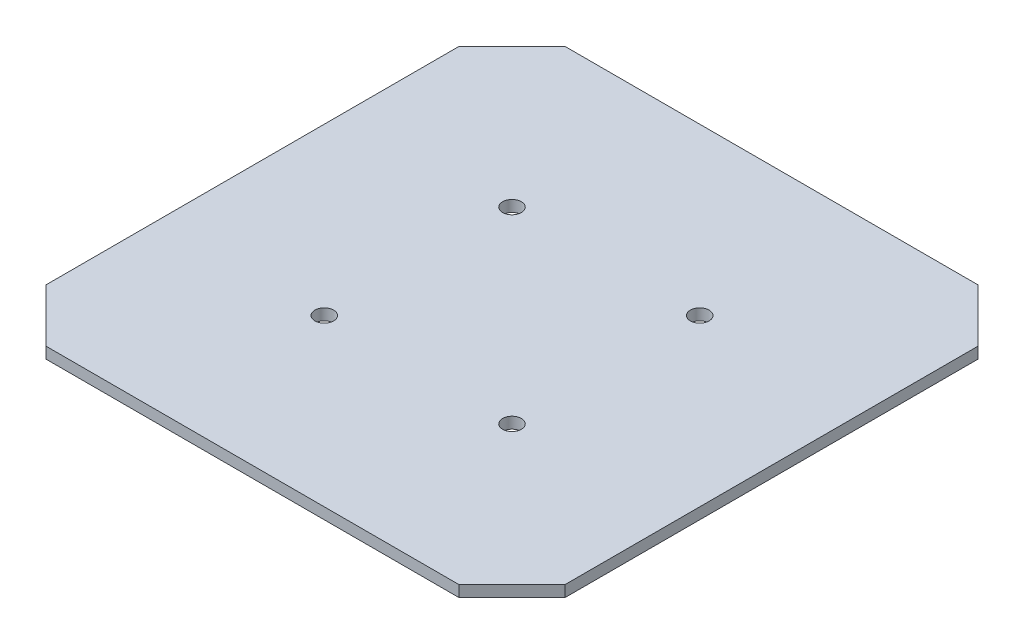
ISO-10303-21;
HEADER;
FILE_DESCRIPTION(('STEP AP214'),'2;1');
FILE_NAME('part.step','',(''),(''),'','','');
FILE_SCHEMA(('AUTOMOTIVE_DESIGN { 1 0 10303 214 1 1 1 1 }'));
ENDSEC;
DATA;
#1=APPLICATION_CONTEXT('core data for automotive mechanical design processes');
#2=APPLICATION_PROTOCOL_DEFINITION('international standard','automotive_design',2000,#1);
#3=PRODUCT_CONTEXT('',#1,'mechanical');
#4=PRODUCT('Part','Part','',(#3));
#5=PRODUCT_RELATED_PRODUCT_CATEGORY('part','',(#4));
#6=PRODUCT_DEFINITION_FORMATION('','',#4);
#7=PRODUCT_DEFINITION_CONTEXT('part definition',#1,'design');
#8=PRODUCT_DEFINITION('design','',#6,#7);
#9=PRODUCT_DEFINITION_SHAPE('','',#8);
#10=(LENGTH_UNIT() NAMED_UNIT(*) SI_UNIT(.MILLI.,.METRE.));
#11=(NAMED_UNIT(*) PLANE_ANGLE_UNIT() SI_UNIT($,.RADIAN.));
#12=(NAMED_UNIT(*) SI_UNIT($,.STERADIAN.) SOLID_ANGLE_UNIT());
#13=UNCERTAINTY_MEASURE_WITH_UNIT(LENGTH_MEASURE(1.E-05),#10,'distance_accuracy_value','');
#14=(GEOMETRIC_REPRESENTATION_CONTEXT(3) GLOBAL_UNCERTAINTY_ASSIGNED_CONTEXT((#13)) GLOBAL_UNIT_ASSIGNED_CONTEXT((#10,
#11,#12)) REPRESENTATION_CONTEXT('',''));
#15=CARTESIAN_POINT('',(0.,0.,0.));
#16=DIRECTION('',(0.,0.,1.));
#17=DIRECTION('',(1.,0.,0.));
#18=AXIS2_PLACEMENT_3D('',#15,#16,#17);
#19=CARTESIAN_POINT('',(-62.0710678118657,3.,-62.0710678118653));
#20=DIRECTION('',(-0.70710678118655,0.,-0.707106781186545));
#21=DIRECTION('',(-0.707106781186545,0.,0.70710678118655));
#22=AXIS2_PLACEMENT_3D('',#19,#20,#21);
#23=PLANE('',#22);
#24=DIRECTION('',(0.707106781186545,0.,-0.70710678118655));
#25=VECTOR('',#24,1.);
#26=CARTESIAN_POINT('',(-62.0710678118657,0.,-62.0710678118653));
#27=LINE('',#26,#25);
#28=CARTESIAN_POINT('',(-69.1421356237309,0.,-55.));
#29=VERTEX_POINT('',#28);
#30=CARTESIAN_POINT('',(-55.,0.,-69.142135623731));
#31=VERTEX_POINT('',#30);
#32=EDGE_CURVE('E144',#29,#31,#27,.T.);
#33=ORIENTED_EDGE('',*,*,#32,.F.);
#34=DIRECTION('',(0.,-1.,0.));
#35=VECTOR('',#34,1.);
#36=CARTESIAN_POINT('',(-69.1421356237309,3.,-55.));
#37=LINE('',#36,#35);
#38=CARTESIAN_POINT('',(-69.1421356237309,3.,-55.));
#39=VERTEX_POINT('',#38);
#40=EDGE_CURVE('E11',#39,#29,#37,.T.);
#41=ORIENTED_EDGE('',*,*,#40,.F.);
#42=DIRECTION('',(0.707106781186545,0.,-0.70710678118655));
#43=VECTOR('',#42,1.);
#44=CARTESIAN_POINT('',(-62.0710678118657,3.,-62.0710678118653));
#45=LINE('',#44,#43);
#46=CARTESIAN_POINT('',(-55.,3.,-69.142135623731));
#47=VERTEX_POINT('',#46);
#48=EDGE_CURVE('E173',#39,#47,#45,.T.);
#49=ORIENTED_EDGE('',*,*,#48,.T.);
#50=DIRECTION('',(0.,-1.,0.));
#51=VECTOR('',#50,1.);
#52=CARTESIAN_POINT('',(-55.,3.,-69.142135623731));
#53=LINE('',#52,#51);
#54=EDGE_CURVE('E54',#47,#31,#53,.T.);
#55=ORIENTED_EDGE('',*,*,#54,.T.);
#56=EDGE_LOOP('',(#33,#41,#49,#55));
#57=FACE_BOUND('',#56,.T.);
#58=ADVANCED_FACE('F38',(#57),#23,.T.);
#59=CARTESIAN_POINT('',(-69.1421356237309,3.,0.));
#60=DIRECTION('',(1.,0.,0.));
#61=DIRECTION('',(0.,0.,-1.));
#62=AXIS2_PLACEMENT_3D('',#59,#60,#61);
#63=PLANE('',#62);
#64=DIRECTION('',(0.,0.,1.));
#65=VECTOR('',#64,1.);
#66=CARTESIAN_POINT('',(-69.1421356237309,0.,0.));
#67=LINE('',#66,#65);
#68=CARTESIAN_POINT('',(-69.1421356237309,0.,55.));
#69=VERTEX_POINT('',#68);
#70=EDGE_CURVE('E146',#29,#69,#67,.T.);
#71=ORIENTED_EDGE('',*,*,#70,.T.);
#72=DIRECTION('',(0.,-1.,0.));
#73=VECTOR('',#72,1.);
#74=CARTESIAN_POINT('',(-69.1421356237309,3.,55.));
#75=LINE('',#74,#73);
#76=CARTESIAN_POINT('',(-69.1421356237309,3.,55.));
#77=VERTEX_POINT('',#76);
#78=EDGE_CURVE('E46',#77,#69,#75,.T.);
#79=ORIENTED_EDGE('',*,*,#78,.F.);
#80=DIRECTION('',(0.,0.,1.));
#81=VECTOR('',#80,1.);
#82=CARTESIAN_POINT('',(-69.1421356237309,3.,0.));
#83=LINE('',#82,#81);
#84=EDGE_CURVE('E207',#39,#77,#83,.T.);
#85=ORIENTED_EDGE('',*,*,#84,.F.);
#86=ORIENTED_EDGE('',*,*,#40,.T.);
#87=EDGE_LOOP('',(#71,#79,#85,#86));
#88=FACE_BOUND('',#87,.T.);
#89=ADVANCED_FACE('F225',(#88),#63,.F.);
#90=CARTESIAN_POINT('',(-62.0710678118657,3.,62.0710678118653));
#91=DIRECTION('',(0.70710678118655,0.,-0.707106781186545));
#92=DIRECTION('',(-0.707106781186545,0.,-0.70710678118655));
#93=AXIS2_PLACEMENT_3D('',#90,#91,#92);
#94=PLANE('',#93);
#95=DIRECTION('',(0.707106781186545,0.,0.70710678118655));
#96=VECTOR('',#95,1.);
#97=CARTESIAN_POINT('',(-62.0710678118657,0.,62.0710678118653));
#98=LINE('',#97,#96);
#99=CARTESIAN_POINT('',(-55.,0.,69.142135623731));
#100=VERTEX_POINT('',#99);
#101=EDGE_CURVE('E148',#69,#100,#98,.T.);
#102=ORIENTED_EDGE('',*,*,#101,.T.);
#103=DIRECTION('',(0.,-1.,0.));
#104=VECTOR('',#103,1.);
#105=CARTESIAN_POINT('',(-55.,3.,69.142135623731));
#106=LINE('',#105,#104);
#107=CARTESIAN_POINT('',(-55.,3.,69.142135623731));
#108=VERTEX_POINT('',#107);
#109=EDGE_CURVE('E180',#108,#100,#106,.T.);
#110=ORIENTED_EDGE('',*,*,#109,.F.);
#111=DIRECTION('',(0.707106781186545,0.,0.70710678118655));
#112=VECTOR('',#111,1.);
#113=CARTESIAN_POINT('',(-62.0710678118657,3.,62.0710678118653));
#114=LINE('',#113,#112);
#115=EDGE_CURVE('E189',#77,#108,#114,.T.);
#116=ORIENTED_EDGE('',*,*,#115,.F.);
#117=ORIENTED_EDGE('',*,*,#78,.T.);
#118=EDGE_LOOP('',(#102,#110,#116,#117));
#119=FACE_BOUND('',#118,.T.);
#120=ADVANCED_FACE('F187',(#119),#94,.F.);
#121=CARTESIAN_POINT('',(0.,3.,69.142135623731));
#122=DIRECTION('',(0.,0.,-1.));
#123=DIRECTION('',(-1.,0.,0.));
#124=AXIS2_PLACEMENT_3D('',#121,#122,#123);
#125=PLANE('',#124);
#126=DIRECTION('',(1.,0.,0.));
#127=VECTOR('',#126,1.);
#128=CARTESIAN_POINT('',(0.,0.,69.142135623731));
#129=LINE('',#128,#127);
#130=CARTESIAN_POINT('',(55.,0.,69.142135623731));
#131=VERTEX_POINT('',#130);
#132=EDGE_CURVE('E150',#100,#131,#129,.T.);
#133=ORIENTED_EDGE('',*,*,#132,.T.);
#134=DIRECTION('',(0.,-1.,0.));
#135=VECTOR('',#134,1.);
#136=CARTESIAN_POINT('',(55.,3.,69.142135623731));
#137=LINE('',#136,#135);
#138=CARTESIAN_POINT('',(55.,3.,69.142135623731));
#139=VERTEX_POINT('',#138);
#140=EDGE_CURVE('E177',#139,#131,#137,.T.);
#141=ORIENTED_EDGE('',*,*,#140,.F.);
#142=DIRECTION('',(1.,0.,0.));
#143=VECTOR('',#142,1.);
#144=CARTESIAN_POINT('',(0.,3.,69.142135623731));
#145=LINE('',#144,#143);
#146=EDGE_CURVE('E203',#108,#139,#145,.T.);
#147=ORIENTED_EDGE('',*,*,#146,.F.);
#148=ORIENTED_EDGE('',*,*,#109,.T.);
#149=EDGE_LOOP('',(#133,#141,#147,#148));
#150=FACE_BOUND('',#149,.T.);
#151=ADVANCED_FACE('F199',(#150),#125,.F.);
#152=CARTESIAN_POINT('',(62.0710678118657,3.,62.0710678118653));
#153=DIRECTION('',(-0.70710678118655,0.,-0.707106781186545));
#154=DIRECTION('',(-0.707106781186545,0.,0.70710678118655));
#155=AXIS2_PLACEMENT_3D('',#152,#153,#154);
#156=PLANE('',#155);
#157=DIRECTION('',(0.707106781186545,0.,-0.70710678118655));
#158=VECTOR('',#157,1.);
#159=CARTESIAN_POINT('',(62.0710678118657,0.,62.0710678118653));
#160=LINE('',#159,#158);
#161=CARTESIAN_POINT('',(69.1421356237309,0.,55.));
#162=VERTEX_POINT('',#161);
#163=EDGE_CURVE('E152',#131,#162,#160,.T.);
#164=ORIENTED_EDGE('',*,*,#163,.T.);
#165=DIRECTION('',(0.,-1.,0.));
#166=VECTOR('',#165,1.);
#167=CARTESIAN_POINT('',(69.1421356237309,3.,55.));
#168=LINE('',#167,#166);
#169=CARTESIAN_POINT('',(69.1421356237309,3.,55.));
#170=VERTEX_POINT('',#169);
#171=EDGE_CURVE('E113',#170,#162,#168,.T.);
#172=ORIENTED_EDGE('',*,*,#171,.F.);
#173=DIRECTION('',(0.707106781186545,0.,-0.70710678118655));
#174=VECTOR('',#173,1.);
#175=CARTESIAN_POINT('',(62.0710678118657,3.,62.0710678118653));
#176=LINE('',#175,#174);
#177=EDGE_CURVE('E123',#139,#170,#176,.T.);
#178=ORIENTED_EDGE('',*,*,#177,.F.);
#179=ORIENTED_EDGE('',*,*,#140,.T.);
#180=EDGE_LOOP('',(#164,#172,#178,#179));
#181=FACE_BOUND('',#180,.T.);
#182=ADVANCED_FACE('F202',(#181),#156,.F.);
#183=CARTESIAN_POINT('',(69.1421356237309,3.,0.));
#184=DIRECTION('',(1.,0.,0.));
#185=DIRECTION('',(0.,0.,-1.));
#186=AXIS2_PLACEMENT_3D('',#183,#184,#185);
#187=PLANE('',#186);
#188=DIRECTION('',(0.,0.,1.));
#189=VECTOR('',#188,1.);
#190=CARTESIAN_POINT('',(69.1421356237309,0.,0.));
#191=LINE('',#190,#189);
#192=CARTESIAN_POINT('',(69.1421356237309,0.,-55.));
#193=VERTEX_POINT('',#192);
#194=EDGE_CURVE('E109',#193,#162,#191,.T.);
#195=ORIENTED_EDGE('',*,*,#194,.F.);
#196=DIRECTION('',(0.,-1.,0.));
#197=VECTOR('',#196,1.);
#198=CARTESIAN_POINT('',(69.1421356237309,3.,-55.));
#199=LINE('',#198,#197);
#200=CARTESIAN_POINT('',(69.1421356237309,3.,-55.));
#201=VERTEX_POINT('',#200);
#202=EDGE_CURVE('E104',#201,#193,#199,.T.);
#203=ORIENTED_EDGE('',*,*,#202,.F.);
#204=DIRECTION('',(0.,0.,1.));
#205=VECTOR('',#204,1.);
#206=CARTESIAN_POINT('',(69.1421356237309,3.,0.));
#207=LINE('',#206,#205);
#208=EDGE_CURVE('E107',#201,#170,#207,.T.);
#209=ORIENTED_EDGE('',*,*,#208,.T.);
#210=ORIENTED_EDGE('',*,*,#171,.T.);
#211=EDGE_LOOP('',(#195,#203,#209,#210));
#212=FACE_BOUND('',#211,.T.);
#213=ADVANCED_FACE('F106',(#212),#187,.T.);
#214=CARTESIAN_POINT('',(62.0710678118656,3.,-62.0710678118653));
#215=DIRECTION('',(0.707106781186549,0.,-0.707106781186546));
#216=DIRECTION('',(-0.707106781186546,0.,-0.707106781186549));
#217=AXIS2_PLACEMENT_3D('',#214,#215,#216);
#218=PLANE('',#217);
#219=DIRECTION('',(0.707106781186546,0.,0.707106781186549));
#220=VECTOR('',#219,1.);
#221=CARTESIAN_POINT('',(62.0710678118656,0.,-62.0710678118653));
#222=LINE('',#221,#220);
#223=CARTESIAN_POINT('',(55.,0.,-69.142135623731));
#224=VERTEX_POINT('',#223);
#225=EDGE_CURVE('E156',#224,#193,#222,.T.);
#226=ORIENTED_EDGE('',*,*,#225,.F.);
#227=DIRECTION('',(0.,-1.,0.));
#228=VECTOR('',#227,1.);
#229=CARTESIAN_POINT('',(55.,3.,-69.142135623731));
#230=LINE('',#229,#228);
#231=CARTESIAN_POINT('',(55.,3.,-69.142135623731));
#232=VERTEX_POINT('',#231);
#233=EDGE_CURVE('E79',#232,#224,#230,.T.);
#234=ORIENTED_EDGE('',*,*,#233,.F.);
#235=DIRECTION('',(0.707106781186546,0.,0.707106781186549));
#236=VECTOR('',#235,1.);
#237=CARTESIAN_POINT('',(62.0710678118656,3.,-62.0710678118653));
#238=LINE('',#237,#236);
#239=EDGE_CURVE('E121',#232,#201,#238,.T.);
#240=ORIENTED_EDGE('',*,*,#239,.T.);
#241=ORIENTED_EDGE('',*,*,#202,.T.);
#242=EDGE_LOOP('',(#226,#234,#240,#241));
#243=FACE_BOUND('',#242,.T.);
#244=ADVANCED_FACE('F126',(#243),#218,.T.);
#245=CARTESIAN_POINT('',(25.0000000000001,3.,-25.));
#246=DIRECTION('',(0.,-1.,0.));
#247=DIRECTION('',(0.,0.,-1.));
#248=AXIS2_PLACEMENT_3D('',#245,#246,#247);
#249=CYLINDRICAL_SURFACE('',#248,2.5);
#250=CARTESIAN_POINT('',(25.0000000000001,3.,-25.));
#251=DIRECTION('',(0.,1.,0.));
#252=DIRECTION('',(0.,0.,1.));
#253=AXIS2_PLACEMENT_3D('',#250,#251,#252);
#254=CIRCLE('',#253,2.5);
#255=CARTESIAN_POINT('',(25.0000000000001,3.,-22.5));
#256=VERTEX_POINT('',#255);
#257=EDGE_CURVE('E138',#256,#256,#254,.T.);
#258=ORIENTED_EDGE('',*,*,#257,.T.);
#259=EDGE_LOOP('',(#258));
#260=FACE_BOUND('',#259,.T.);
#261=CARTESIAN_POINT('',(25.0000000000001,0.,-25.));
#262=DIRECTION('',(0.,1.,0.));
#263=DIRECTION('',(0.,0.,1.));
#264=AXIS2_PLACEMENT_3D('',#261,#262,#263);
#265=CIRCLE('',#264,2.5);
#266=CARTESIAN_POINT('',(25.0000000000001,0.,-22.5));
#267=VERTEX_POINT('',#266);
#268=EDGE_CURVE('E167',#267,#267,#265,.T.);
#269=ORIENTED_EDGE('',*,*,#268,.F.);
#270=EDGE_LOOP('',(#269));
#271=FACE_BOUND('',#270,.T.);
#272=ADVANCED_FACE('F240',(#260,#271),#249,.F.);
#273=CARTESIAN_POINT('',(25.0000000000001,3.,25.));
#274=DIRECTION('',(0.,-1.,0.));
#275=DIRECTION('',(0.,0.,-1.));
#276=AXIS2_PLACEMENT_3D('',#273,#274,#275);
#277=CYLINDRICAL_SURFACE('',#276,2.5);
#278=CARTESIAN_POINT('',(25.0000000000001,3.,25.));
#279=DIRECTION('',(0.,1.,0.));
#280=DIRECTION('',(0.,0.,1.));
#281=AXIS2_PLACEMENT_3D('',#278,#279,#280);
#282=CIRCLE('',#281,2.5);
#283=CARTESIAN_POINT('',(25.0000000000001,3.,27.5));
#284=VERTEX_POINT('',#283);
#285=EDGE_CURVE('E135',#284,#284,#282,.T.);
#286=ORIENTED_EDGE('',*,*,#285,.T.);
#287=EDGE_LOOP('',(#286));
#288=FACE_BOUND('',#287,.T.);
#289=CARTESIAN_POINT('',(25.0000000000001,0.,25.));
#290=DIRECTION('',(0.,1.,0.));
#291=DIRECTION('',(0.,0.,1.));
#292=AXIS2_PLACEMENT_3D('',#289,#290,#291);
#293=CIRCLE('',#292,2.5);
#294=CARTESIAN_POINT('',(25.0000000000001,0.,27.5));
#295=VERTEX_POINT('',#294);
#296=EDGE_CURVE('E164',#295,#295,#293,.T.);
#297=ORIENTED_EDGE('',*,*,#296,.F.);
#298=EDGE_LOOP('',(#297));
#299=FACE_BOUND('',#298,.T.);
#300=ADVANCED_FACE('F220',(#288,#299),#277,.F.);
#301=CARTESIAN_POINT('',(-24.9999999999999,3.,25.));
#302=DIRECTION('',(0.,-1.,0.));
#303=DIRECTION('',(0.,0.,-1.));
#304=AXIS2_PLACEMENT_3D('',#301,#302,#303);
#305=CYLINDRICAL_SURFACE('',#304,2.5);
#306=CARTESIAN_POINT('',(-24.9999999999999,3.,25.));
#307=DIRECTION('',(0.,1.,0.));
#308=DIRECTION('',(0.,0.,1.));
#309=AXIS2_PLACEMENT_3D('',#306,#307,#308);
#310=CIRCLE('',#309,2.5);
#311=CARTESIAN_POINT('',(-24.9999999999999,3.,27.5));
#312=VERTEX_POINT('',#311);
#313=EDGE_CURVE('E129',#312,#312,#310,.T.);
#314=ORIENTED_EDGE('',*,*,#313,.T.);
#315=EDGE_LOOP('',(#314));
#316=FACE_BOUND('',#315,.T.);
#317=CARTESIAN_POINT('',(-24.9999999999999,0.,25.));
#318=DIRECTION('',(0.,1.,0.));
#319=DIRECTION('',(0.,0.,1.));
#320=AXIS2_PLACEMENT_3D('',#317,#318,#319);
#321=CIRCLE('',#320,2.5);
#322=CARTESIAN_POINT('',(-24.9999999999999,0.,27.5));
#323=VERTEX_POINT('',#322);
#324=EDGE_CURVE('E161',#323,#323,#321,.T.);
#325=ORIENTED_EDGE('',*,*,#324,.F.);
#326=EDGE_LOOP('',(#325));
#327=FACE_BOUND('',#326,.T.);
#328=ADVANCED_FACE('F212',(#316,#327),#305,.F.);
#329=CARTESIAN_POINT('',(0.,3.,-69.142135623731));
#330=DIRECTION('',(0.,0.,-1.));
#331=DIRECTION('',(-1.,0.,0.));
#332=AXIS2_PLACEMENT_3D('',#329,#330,#331);
#333=PLANE('',#332);
#334=DIRECTION('',(1.,0.,0.));
#335=VECTOR('',#334,1.);
#336=CARTESIAN_POINT('',(0.,0.,-69.142135623731));
#337=LINE('',#336,#335);
#338=EDGE_CURVE('E158',#31,#224,#337,.T.);
#339=ORIENTED_EDGE('',*,*,#338,.F.);
#340=ORIENTED_EDGE('',*,*,#54,.F.);
#341=DIRECTION('',(1.,0.,0.));
#342=VECTOR('',#341,1.);
#343=CARTESIAN_POINT('',(0.,3.,-69.142135623731));
#344=LINE('',#343,#342);
#345=EDGE_CURVE('E127',#47,#232,#344,.T.);
#346=ORIENTED_EDGE('',*,*,#345,.T.);
#347=ORIENTED_EDGE('',*,*,#233,.T.);
#348=EDGE_LOOP('',(#339,#340,#346,#347));
#349=FACE_BOUND('',#348,.T.);
#350=ADVANCED_FACE('F209',(#349),#333,.T.);
#351=CARTESIAN_POINT('',(-24.9999999999999,3.,-25.));
#352=DIRECTION('',(0.,-1.,0.));
#353=DIRECTION('',(0.,0.,-1.));
#354=AXIS2_PLACEMENT_3D('',#351,#352,#353);
#355=CYLINDRICAL_SURFACE('',#354,2.5);
#356=CARTESIAN_POINT('',(-24.9999999999999,3.,-25.));
#357=DIRECTION('',(0.,1.,0.));
#358=DIRECTION('',(0.,0.,1.));
#359=AXIS2_PLACEMENT_3D('',#356,#357,#358);
#360=CIRCLE('',#359,2.5);
#361=CARTESIAN_POINT('',(-24.9999999999999,3.,-22.5));
#362=VERTEX_POINT('',#361);
#363=EDGE_CURVE('E141',#362,#362,#360,.T.);
#364=ORIENTED_EDGE('',*,*,#363,.T.);
#365=EDGE_LOOP('',(#364));
#366=FACE_BOUND('',#365,.T.);
#367=CARTESIAN_POINT('',(-24.9999999999999,0.,-25.));
#368=DIRECTION('',(0.,1.,0.));
#369=DIRECTION('',(0.,0.,1.));
#370=AXIS2_PLACEMENT_3D('',#367,#368,#369);
#371=CIRCLE('',#370,2.5);
#372=CARTESIAN_POINT('',(-24.9999999999999,0.,-22.5));
#373=VERTEX_POINT('',#372);
#374=EDGE_CURVE('E170',#373,#373,#371,.T.);
#375=ORIENTED_EDGE('',*,*,#374,.F.);
#376=EDGE_LOOP('',(#375));
#377=FACE_BOUND('',#376,.T.);
#378=ADVANCED_FACE('F211',(#366,#377),#355,.F.);
#379=CARTESIAN_POINT('',(0.,3.,0.));
#380=DIRECTION('',(0.,1.,0.));
#381=DIRECTION('',(0.,0.,1.));
#382=AXIS2_PLACEMENT_3D('',#379,#380,#381);
#383=PLANE('',#382);
#384=ORIENTED_EDGE('',*,*,#48,.F.);
#385=ORIENTED_EDGE('',*,*,#84,.T.);
#386=ORIENTED_EDGE('',*,*,#115,.T.);
#387=ORIENTED_EDGE('',*,*,#146,.T.);
#388=ORIENTED_EDGE('',*,*,#177,.T.);
#389=ORIENTED_EDGE('',*,*,#208,.F.);
#390=ORIENTED_EDGE('',*,*,#239,.F.);
#391=ORIENTED_EDGE('',*,*,#345,.F.);
#392=EDGE_LOOP('',(#384,#385,#386,#387,#388,#389,#390,#391));
#393=FACE_BOUND('',#392,.T.);
#394=ORIENTED_EDGE('',*,*,#313,.F.);
#395=EDGE_LOOP('',(#394));
#396=FACE_BOUND('',#395,.T.);
#397=ORIENTED_EDGE('',*,*,#285,.F.);
#398=EDGE_LOOP('',(#397));
#399=FACE_BOUND('',#398,.T.);
#400=ORIENTED_EDGE('',*,*,#257,.F.);
#401=EDGE_LOOP('',(#400));
#402=FACE_BOUND('',#401,.T.);
#403=ORIENTED_EDGE('',*,*,#363,.F.);
#404=EDGE_LOOP('',(#403));
#405=FACE_BOUND('',#404,.T.);
#406=ADVANCED_FACE('F118',(#393,#396,#399,#402,#405),#383,.T.);
#407=CARTESIAN_POINT('',(0.,0.,0.));
#408=DIRECTION('',(0.,1.,0.));
#409=DIRECTION('',(0.,0.,1.));
#410=AXIS2_PLACEMENT_3D('',#407,#408,#409);
#411=PLANE('',#410);
#412=ORIENTED_EDGE('',*,*,#32,.T.);
#413=ORIENTED_EDGE('',*,*,#338,.T.);
#414=ORIENTED_EDGE('',*,*,#225,.T.);
#415=ORIENTED_EDGE('',*,*,#194,.T.);
#416=ORIENTED_EDGE('',*,*,#163,.F.);
#417=ORIENTED_EDGE('',*,*,#132,.F.);
#418=ORIENTED_EDGE('',*,*,#101,.F.);
#419=ORIENTED_EDGE('',*,*,#70,.F.);
#420=EDGE_LOOP('',(#412,#413,#414,#415,#416,#417,#418,#419));
#421=FACE_BOUND('',#420,.T.);
#422=ORIENTED_EDGE('',*,*,#324,.T.);
#423=EDGE_LOOP('',(#422));
#424=FACE_BOUND('',#423,.T.);
#425=ORIENTED_EDGE('',*,*,#296,.T.);
#426=EDGE_LOOP('',(#425));
#427=FACE_BOUND('',#426,.T.);
#428=ORIENTED_EDGE('',*,*,#268,.T.);
#429=EDGE_LOOP('',(#428));
#430=FACE_BOUND('',#429,.T.);
#431=ORIENTED_EDGE('',*,*,#374,.T.);
#432=EDGE_LOOP('',(#431));
#433=FACE_BOUND('',#432,.T.);
#434=ADVANCED_FACE('F194',(#421,#424,#427,#430,#433),#411,.F.);
#435=CLOSED_SHELL('',(#58,#89,#120,#151,#182,#213,#244,#272,#300,#328,#350,#378,#406,#434));
#436=MANIFOLD_SOLID_BREP('B2',#435);
#437=ADVANCED_BREP_SHAPE_REPRESENTATION('',(#18,#436),#14);
#438=SHAPE_DEFINITION_REPRESENTATION(#9,#437);
ENDSEC;
END-ISO-10303-21;
